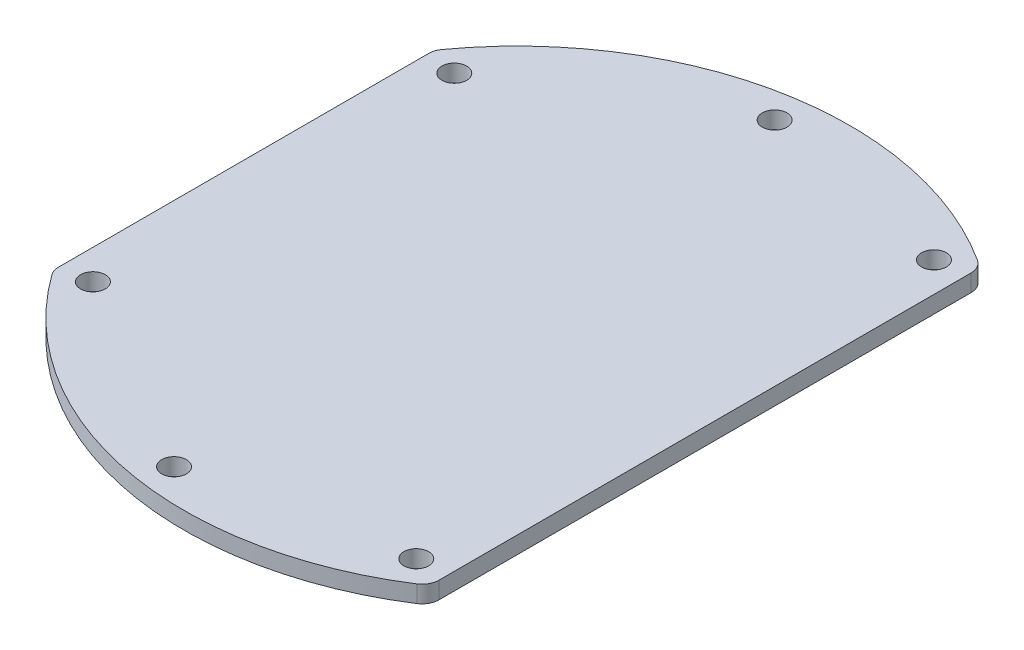
ISO-10303-21;
HEADER;
FILE_DESCRIPTION(('STEP AP214'),'2;1');
FILE_NAME('part.step','',(''),(''),'','','');
FILE_SCHEMA(('AUTOMOTIVE_DESIGN { 1 0 10303 214 1 1 1 1 }'));
ENDSEC;
DATA;
#1=APPLICATION_CONTEXT('core data for automotive mechanical design processes');
#2=APPLICATION_PROTOCOL_DEFINITION('international standard','automotive_design',2000,#1);
#3=PRODUCT_CONTEXT('',#1,'mechanical');
#4=PRODUCT('Part','Part','',(#3));
#5=PRODUCT_RELATED_PRODUCT_CATEGORY('part','',(#4));
#6=PRODUCT_DEFINITION_FORMATION('','',#4);
#7=PRODUCT_DEFINITION_CONTEXT('part definition',#1,'design');
#8=PRODUCT_DEFINITION('design','',#6,#7);
#9=PRODUCT_DEFINITION_SHAPE('','',#8);
#10=(LENGTH_UNIT() NAMED_UNIT(*) SI_UNIT(.MILLI.,.METRE.));
#11=(NAMED_UNIT(*) PLANE_ANGLE_UNIT() SI_UNIT($,.RADIAN.));
#12=(NAMED_UNIT(*) SI_UNIT($,.STERADIAN.) SOLID_ANGLE_UNIT());
#13=UNCERTAINTY_MEASURE_WITH_UNIT(LENGTH_MEASURE(1.E-05),#10,'distance_accuracy_value','');
#14=(GEOMETRIC_REPRESENTATION_CONTEXT(3) GLOBAL_UNCERTAINTY_ASSIGNED_CONTEXT((#13)) GLOBAL_UNIT_ASSIGNED_CONTEXT((#10,
#11,#12)) REPRESENTATION_CONTEXT('',''));
#15=CARTESIAN_POINT('',(0.,0.,0.));
#16=DIRECTION('',(0.,0.,1.));
#17=DIRECTION('',(1.,0.,0.));
#18=AXIS2_PLACEMENT_3D('',#15,#16,#17);
#19=CARTESIAN_POINT('',(0.,2.,0.));
#20=DIRECTION('',(0.,-1.,0.));
#21=DIRECTION('',(0.,0.,-1.));
#22=AXIS2_PLACEMENT_3D('',#19,#20,#21);
#23=CYLINDRICAL_SURFACE('',#22,39.);
#24=CARTESIAN_POINT('',(0.,2.,0.));
#25=DIRECTION('',(0.,1.,0.));
#26=DIRECTION('',(0.,0.,1.));
#27=AXIS2_PLACEMENT_3D('',#24,#25,#26);
#28=CIRCLE('',#27,39.);
#29=CARTESIAN_POINT('',(21.0810810810811,2.,-32.8114007694412));
#30=VERTEX_POINT('',#29);
#31=CARTESIAN_POINT('',(-31.6216216216216,2.,-22.8270244670433));
#32=VERTEX_POINT('',#31);
#33=EDGE_CURVE('E130',#30,#32,#28,.T.);
#34=ORIENTED_EDGE('',*,*,#33,.F.);
#35=DIRECTION('',(0.,-1.,0.));
#36=VECTOR('',#35,1.);
#37=CARTESIAN_POINT('',(21.0810810810811,2.,-32.8114007694412));
#38=LINE('',#37,#36);
#39=CARTESIAN_POINT('',(21.0810810810811,0.,-32.8114007694412));
#40=VERTEX_POINT('',#39);
#41=EDGE_CURVE('E11',#30,#40,#38,.T.);
#42=ORIENTED_EDGE('',*,*,#41,.T.);
#43=CARTESIAN_POINT('',(0.,0.,0.));
#44=DIRECTION('',(0.,1.,0.));
#45=DIRECTION('',(0.,0.,1.));
#46=AXIS2_PLACEMENT_3D('',#43,#44,#45);
#47=CIRCLE('',#46,39.);
#48=CARTESIAN_POINT('',(-31.6216216216216,0.,-22.8270244670433));
#49=VERTEX_POINT('',#48);
#50=EDGE_CURVE('E161',#40,#49,#47,.T.);
#51=ORIENTED_EDGE('',*,*,#50,.T.);
#52=DIRECTION('',(0.,-1.,0.));
#53=VECTOR('',#52,1.);
#54=CARTESIAN_POINT('',(-31.6216216216216,2.,-22.8270244670433));
#55=LINE('',#54,#53);
#56=EDGE_CURVE('E44',#49,#32,#55,.F.);
#57=ORIENTED_EDGE('',*,*,#56,.T.);
#58=EDGE_LOOP('',(#34,#42,#51,#57));
#59=FACE_BOUND('',#58,.T.);
#60=ADVANCED_FACE('F36',(#59),#23,.T.);
#61=CARTESIAN_POINT('',(-32.,2.,-22.2934968096079));
#62=DIRECTION('',(1.,0.,0.));
#63=DIRECTION('',(0.,0.,-1.));
#64=AXIS2_PLACEMENT_3D('',#61,#62,#63);
#65=PLANE('',#64);
#66=DIRECTION('',(0.,0.,1.));
#67=VECTOR('',#66,1.);
#68=CARTESIAN_POINT('',(-32.,0.,-22.2934968096079));
#69=LINE('',#68,#67);
#70=CARTESIAN_POINT('',(-32.,0.,-21.6564078277077));
#71=VERTEX_POINT('',#70);
#72=CARTESIAN_POINT('',(-32.,0.,21.6564078277077));
#73=VERTEX_POINT('',#72);
#74=EDGE_CURVE('E135',#71,#73,#69,.T.);
#75=ORIENTED_EDGE('',*,*,#74,.T.);
#76=DIRECTION('',(0.,-1.,0.));
#77=VECTOR('',#76,1.);
#78=CARTESIAN_POINT('',(-32.,2.,21.6564078277077));
#79=LINE('',#78,#77);
#80=CARTESIAN_POINT('',(-32.,2.,21.6564078277077));
#81=VERTEX_POINT('',#80);
#82=EDGE_CURVE('E51',#73,#81,#79,.F.);
#83=ORIENTED_EDGE('',*,*,#82,.T.);
#84=DIRECTION('',(0.,0.,1.));
#85=VECTOR('',#84,1.);
#86=CARTESIAN_POINT('',(-32.,2.,-22.2934968096079));
#87=LINE('',#86,#85);
#88=CARTESIAN_POINT('',(-32.,2.,-21.6564078277077));
#89=VERTEX_POINT('',#88);
#90=EDGE_CURVE('E133',#89,#81,#87,.T.);
#91=ORIENTED_EDGE('',*,*,#90,.F.);
#92=DIRECTION('',(0.,-1.,0.));
#93=VECTOR('',#92,1.);
#94=CARTESIAN_POINT('',(-32.,2.,-21.6564078277077));
#95=LINE('',#94,#93);
#96=EDGE_CURVE('E153',#89,#71,#95,.T.);
#97=ORIENTED_EDGE('',*,*,#96,.T.);
#98=EDGE_LOOP('',(#75,#83,#91,#97));
#99=FACE_BOUND('',#98,.T.);
#100=ADVANCED_FACE('F168',(#99),#65,.F.);
#101=CARTESIAN_POINT('',(0.,2.,0.));
#102=DIRECTION('',(0.,-1.,0.));
#103=DIRECTION('',(0.,0.,-1.));
#104=AXIS2_PLACEMENT_3D('',#101,#102,#103);
#105=CYLINDRICAL_SURFACE('',#104,39.);
#106=CARTESIAN_POINT('',(0.,0.,0.));
#107=DIRECTION('',(0.,1.,0.));
#108=DIRECTION('',(0.,0.,1.));
#109=AXIS2_PLACEMENT_3D('',#106,#107,#108);
#110=CIRCLE('',#109,39.);
#111=CARTESIAN_POINT('',(-31.6216216216216,0.,22.8270244670433));
#112=VERTEX_POINT('',#111);
#113=CARTESIAN_POINT('',(21.0810810810811,0.,32.8114007694412));
#114=VERTEX_POINT('',#113);
#115=EDGE_CURVE('E131',#112,#114,#110,.T.);
#116=ORIENTED_EDGE('',*,*,#115,.T.);
#117=DIRECTION('',(0.,-1.,0.));
#118=VECTOR('',#117,1.);
#119=CARTESIAN_POINT('',(21.0810810810811,2.,32.8114007694412));
#120=LINE('',#119,#118);
#121=CARTESIAN_POINT('',(21.0810810810811,2.,32.8114007694412));
#122=VERTEX_POINT('',#121);
#123=EDGE_CURVE('E108',#114,#122,#120,.F.);
#124=ORIENTED_EDGE('',*,*,#123,.T.);
#125=CARTESIAN_POINT('',(0.,2.,0.));
#126=DIRECTION('',(0.,1.,0.));
#127=DIRECTION('',(0.,0.,1.));
#128=AXIS2_PLACEMENT_3D('',#125,#126,#127);
#129=CIRCLE('',#128,39.);
#130=CARTESIAN_POINT('',(-31.6216216216216,2.,22.8270244670433));
#131=VERTEX_POINT('',#130);
#132=EDGE_CURVE('E173',#131,#122,#129,.T.);
#133=ORIENTED_EDGE('',*,*,#132,.F.);
#134=DIRECTION('',(0.,-1.,0.));
#135=VECTOR('',#134,1.);
#136=CARTESIAN_POINT('',(-31.6216216216216,2.,22.8270244670433));
#137=LINE('',#136,#135);
#138=EDGE_CURVE('E113',#131,#112,#137,.T.);
#139=ORIENTED_EDGE('',*,*,#138,.T.);
#140=EDGE_LOOP('',(#116,#124,#133,#139));
#141=FACE_BOUND('',#140,.T.);
#142=ADVANCED_FACE('F246',(#141),#105,.T.);
#143=CARTESIAN_POINT('',(22.,2.,32.2024843762092));
#144=DIRECTION('',(-1.,0.,0.));
#145=DIRECTION('',(0.,0.,1.));
#146=AXIS2_PLACEMENT_3D('',#143,#144,#145);
#147=PLANE('',#146);
#148=DIRECTION('',(0.,0.,-1.));
#149=VECTOR('',#148,1.);
#150=CARTESIAN_POINT('',(22.,2.,32.2024843762092));
#151=LINE('',#150,#149);
#152=CARTESIAN_POINT('',(22.,2.,31.1287648325468));
#153=VERTEX_POINT('',#152);
#154=CARTESIAN_POINT('',(22.,2.,-31.1287648325468));
#155=VERTEX_POINT('',#154);
#156=EDGE_CURVE('E123',#153,#155,#151,.T.);
#157=ORIENTED_EDGE('',*,*,#156,.F.);
#158=DIRECTION('',(0.,-1.,0.));
#159=VECTOR('',#158,1.);
#160=CARTESIAN_POINT('',(22.,2.,31.1287648325468));
#161=LINE('',#160,#159);
#162=CARTESIAN_POINT('',(22.,0.,31.1287648325468));
#163=VERTEX_POINT('',#162);
#164=EDGE_CURVE('E107',#153,#163,#161,.T.);
#165=ORIENTED_EDGE('',*,*,#164,.T.);
#166=DIRECTION('',(0.,0.,-1.));
#167=VECTOR('',#166,1.);
#168=CARTESIAN_POINT('',(22.,0.,32.2024843762092));
#169=LINE('',#168,#167);
#170=CARTESIAN_POINT('',(22.,0.,-31.1287648325468));
#171=VERTEX_POINT('',#170);
#172=EDGE_CURVE('E120',#163,#171,#169,.T.);
#173=ORIENTED_EDGE('',*,*,#172,.T.);
#174=DIRECTION('',(0.,-1.,0.));
#175=VECTOR('',#174,1.);
#176=CARTESIAN_POINT('',(22.,2.,-31.1287648325468));
#177=LINE('',#176,#175);
#178=EDGE_CURVE('E125',#171,#155,#177,.F.);
#179=ORIENTED_EDGE('',*,*,#178,.T.);
#180=EDGE_LOOP('',(#157,#165,#173,#179));
#181=FACE_BOUND('',#180,.T.);
#182=ADVANCED_FACE('F119',(#181),#147,.F.);
#183=CARTESIAN_POINT('',(0.,2.,0.));
#184=DIRECTION('',(0.,1.,0.));
#185=DIRECTION('',(0.,0.,1.));
#186=AXIS2_PLACEMENT_3D('',#183,#184,#185);
#187=PLANE('',#186);
#188=CARTESIAN_POINT('',(-28.5,2.,-21.15));
#189=DIRECTION('',(0.,1.,0.));
#190=DIRECTION('',(0.,0.,1.));
#191=AXIS2_PLACEMENT_3D('',#188,#189,#190);
#192=CIRCLE('',#191,1.45);
#193=CARTESIAN_POINT('',(-28.5,2.,-19.7));
#194=VERTEX_POINT('',#193);
#195=EDGE_CURVE('E208',#194,#194,#192,.T.);
#196=ORIENTED_EDGE('',*,*,#195,.F.);
#197=EDGE_LOOP('',(#196));
#198=FACE_BOUND('',#197,.T.);
#199=CARTESIAN_POINT('',(-28.5,2.,21.15));
#200=DIRECTION('',(0.,1.,0.));
#201=DIRECTION('',(0.,0.,1.));
#202=AXIS2_PLACEMENT_3D('',#199,#200,#201);
#203=CIRCLE('',#202,1.45);
#204=CARTESIAN_POINT('',(-28.5,2.,22.6));
#205=VERTEX_POINT('',#204);
#206=EDGE_CURVE('E202',#205,#205,#203,.T.);
#207=ORIENTED_EDGE('',*,*,#206,.F.);
#208=EDGE_LOOP('',(#207));
#209=FACE_BOUND('',#208,.T.);
#210=CARTESIAN_POINT('',(18.5,2.,30.3));
#211=DIRECTION('',(0.,1.,0.));
#212=DIRECTION('',(0.,0.,1.));
#213=AXIS2_PLACEMENT_3D('',#210,#211,#212);
#214=CIRCLE('',#213,1.45);
#215=CARTESIAN_POINT('',(18.5,2.,31.75));
#216=VERTEX_POINT('',#215);
#217=EDGE_CURVE('E196',#216,#216,#214,.T.);
#218=ORIENTED_EDGE('',*,*,#217,.F.);
#219=EDGE_LOOP('',(#218));
#220=FACE_BOUND('',#219,.T.);
#221=CARTESIAN_POINT('',(18.5,2.,-30.3));
#222=DIRECTION('',(0.,1.,0.));
#223=DIRECTION('',(0.,0.,1.));
#224=AXIS2_PLACEMENT_3D('',#221,#222,#223);
#225=CIRCLE('',#224,1.45);
#226=CARTESIAN_POINT('',(18.5,2.,-28.85));
#227=VERTEX_POINT('',#226);
#228=EDGE_CURVE('E190',#227,#227,#225,.T.);
#229=ORIENTED_EDGE('',*,*,#228,.F.);
#230=EDGE_LOOP('',(#229));
#231=FACE_BOUND('',#230,.T.);
#232=CARTESIAN_POINT('',(-5.00000000000001,2.,-35.15));
#233=DIRECTION('',(0.,1.,0.));
#234=DIRECTION('',(0.,0.,1.));
#235=AXIS2_PLACEMENT_3D('',#232,#233,#234);
#236=CIRCLE('',#235,1.45);
#237=CARTESIAN_POINT('',(-5.00000000000001,2.,-33.7));
#238=VERTEX_POINT('',#237);
#239=EDGE_CURVE('E184',#238,#238,#236,.T.);
#240=ORIENTED_EDGE('',*,*,#239,.F.);
#241=EDGE_LOOP('',(#240));
#242=FACE_BOUND('',#241,.T.);
#243=CARTESIAN_POINT('',(-5.,2.,35.15));
#244=DIRECTION('',(0.,1.,0.));
#245=DIRECTION('',(0.,0.,1.));
#246=AXIS2_PLACEMENT_3D('',#243,#244,#245);
#247=CIRCLE('',#246,1.45);
#248=CARTESIAN_POINT('',(-5.,2.,36.6));
#249=VERTEX_POINT('',#248);
#250=EDGE_CURVE('E178',#249,#249,#247,.T.);
#251=ORIENTED_EDGE('',*,*,#250,.F.);
#252=EDGE_LOOP('',(#251));
#253=FACE_BOUND('',#252,.T.);
#254=ORIENTED_EDGE('',*,*,#132,.T.);
#255=CARTESIAN_POINT('',(20.,2.,31.1287648325468));
#256=DIRECTION('',(0.,1.,0.));
#257=DIRECTION('',(0.,0.,1.));
#258=AXIS2_PLACEMENT_3D('',#255,#256,#257);
#259=CIRCLE('',#258,2.);
#260=EDGE_CURVE('E151',#122,#153,#259,.T.);
#261=ORIENTED_EDGE('',*,*,#260,.T.);
#262=ORIENTED_EDGE('',*,*,#156,.T.);
#263=CARTESIAN_POINT('',(20.,2.,-31.1287648325468));
#264=DIRECTION('',(0.,1.,0.));
#265=DIRECTION('',(0.,0.,1.));
#266=AXIS2_PLACEMENT_3D('',#263,#264,#265);
#267=CIRCLE('',#266,2.);
#268=EDGE_CURVE('E147',#155,#30,#267,.T.);
#269=ORIENTED_EDGE('',*,*,#268,.T.);
#270=ORIENTED_EDGE('',*,*,#33,.T.);
#271=CARTESIAN_POINT('',(-30.,2.,-21.6564078277077));
#272=DIRECTION('',(0.,1.,0.));
#273=DIRECTION('',(0.,0.,1.));
#274=AXIS2_PLACEMENT_3D('',#271,#272,#273);
#275=CIRCLE('',#274,2.);
#276=EDGE_CURVE('E58',#32,#89,#275,.T.);
#277=ORIENTED_EDGE('',*,*,#276,.T.);
#278=ORIENTED_EDGE('',*,*,#90,.T.);
#279=CARTESIAN_POINT('',(-30.,2.,21.6564078277077));
#280=DIRECTION('',(0.,1.,0.));
#281=DIRECTION('',(0.,0.,1.));
#282=AXIS2_PLACEMENT_3D('',#279,#280,#281);
#283=CIRCLE('',#282,2.);
#284=EDGE_CURVE('E149',#81,#131,#283,.T.);
#285=ORIENTED_EDGE('',*,*,#284,.T.);
#286=EDGE_LOOP('',(#254,#261,#262,#269,#270,#277,#278,#285));
#287=FACE_BOUND('',#286,.T.);
#288=ADVANCED_FACE('F164',(#198,#209,#220,#231,#242,#253,#287),#187,.T.);
#289=CARTESIAN_POINT('',(0.,0.,0.));
#290=DIRECTION('',(0.,1.,0.));
#291=DIRECTION('',(0.,0.,1.));
#292=AXIS2_PLACEMENT_3D('',#289,#290,#291);
#293=PLANE('',#292);
#294=CARTESIAN_POINT('',(-28.5,0.,-21.15));
#295=DIRECTION('',(0.,1.,0.));
#296=DIRECTION('',(0.,0.,1.));
#297=AXIS2_PLACEMENT_3D('',#294,#295,#296);
#298=CIRCLE('',#297,1.45);
#299=CARTESIAN_POINT('',(-28.5,0.,-19.7));
#300=VERTEX_POINT('',#299);
#301=EDGE_CURVE('E205',#300,#300,#298,.T.);
#302=ORIENTED_EDGE('',*,*,#301,.T.);
#303=EDGE_LOOP('',(#302));
#304=FACE_BOUND('',#303,.T.);
#305=CARTESIAN_POINT('',(-28.5,0.,21.15));
#306=DIRECTION('',(0.,1.,0.));
#307=DIRECTION('',(0.,0.,1.));
#308=AXIS2_PLACEMENT_3D('',#305,#306,#307);
#309=CIRCLE('',#308,1.45);
#310=CARTESIAN_POINT('',(-28.5,0.,22.6));
#311=VERTEX_POINT('',#310);
#312=EDGE_CURVE('E199',#311,#311,#309,.T.);
#313=ORIENTED_EDGE('',*,*,#312,.T.);
#314=EDGE_LOOP('',(#313));
#315=FACE_BOUND('',#314,.T.);
#316=CARTESIAN_POINT('',(18.5,0.,30.3));
#317=DIRECTION('',(0.,1.,0.));
#318=DIRECTION('',(0.,0.,1.));
#319=AXIS2_PLACEMENT_3D('',#316,#317,#318);
#320=CIRCLE('',#319,1.45);
#321=CARTESIAN_POINT('',(18.5,0.,31.75));
#322=VERTEX_POINT('',#321);
#323=EDGE_CURVE('E193',#322,#322,#320,.T.);
#324=ORIENTED_EDGE('',*,*,#323,.T.);
#325=EDGE_LOOP('',(#324));
#326=FACE_BOUND('',#325,.T.);
#327=CARTESIAN_POINT('',(18.5,0.,-30.3));
#328=DIRECTION('',(0.,1.,0.));
#329=DIRECTION('',(0.,0.,1.));
#330=AXIS2_PLACEMENT_3D('',#327,#328,#329);
#331=CIRCLE('',#330,1.45);
#332=CARTESIAN_POINT('',(18.5,0.,-28.85));
#333=VERTEX_POINT('',#332);
#334=EDGE_CURVE('E187',#333,#333,#331,.T.);
#335=ORIENTED_EDGE('',*,*,#334,.T.);
#336=EDGE_LOOP('',(#335));
#337=FACE_BOUND('',#336,.T.);
#338=CARTESIAN_POINT('',(-5.00000000000001,0.,-35.15));
#339=DIRECTION('',(0.,1.,0.));
#340=DIRECTION('',(0.,0.,1.));
#341=AXIS2_PLACEMENT_3D('',#338,#339,#340);
#342=CIRCLE('',#341,1.45);
#343=CARTESIAN_POINT('',(-5.00000000000001,0.,-33.7));
#344=VERTEX_POINT('',#343);
#345=EDGE_CURVE('E181',#344,#344,#342,.T.);
#346=ORIENTED_EDGE('',*,*,#345,.T.);
#347=EDGE_LOOP('',(#346));
#348=FACE_BOUND('',#347,.T.);
#349=CARTESIAN_POINT('',(-5.,0.,35.15));
#350=DIRECTION('',(0.,1.,0.));
#351=DIRECTION('',(0.,0.,1.));
#352=AXIS2_PLACEMENT_3D('',#349,#350,#351);
#353=CIRCLE('',#352,1.45);
#354=CARTESIAN_POINT('',(-5.,0.,36.6));
#355=VERTEX_POINT('',#354);
#356=EDGE_CURVE('E169',#355,#355,#353,.T.);
#357=ORIENTED_EDGE('',*,*,#356,.T.);
#358=EDGE_LOOP('',(#357));
#359=FACE_BOUND('',#358,.T.);
#360=ORIENTED_EDGE('',*,*,#172,.F.);
#361=CARTESIAN_POINT('',(20.,0.,31.1287648325468));
#362=DIRECTION('',(0.,1.,0.));
#363=DIRECTION('',(0.,0.,1.));
#364=AXIS2_PLACEMENT_3D('',#361,#362,#363);
#365=CIRCLE('',#364,2.);
#366=EDGE_CURVE('E103',#163,#114,#365,.F.);
#367=ORIENTED_EDGE('',*,*,#366,.T.);
#368=ORIENTED_EDGE('',*,*,#115,.F.);
#369=CARTESIAN_POINT('',(-30.,0.,21.6564078277077));
#370=DIRECTION('',(0.,1.,0.));
#371=DIRECTION('',(0.,0.,1.));
#372=AXIS2_PLACEMENT_3D('',#369,#370,#371);
#373=CIRCLE('',#372,2.);
#374=EDGE_CURVE('E114',#112,#73,#373,.F.);
#375=ORIENTED_EDGE('',*,*,#374,.T.);
#376=ORIENTED_EDGE('',*,*,#74,.F.);
#377=CARTESIAN_POINT('',(-30.,0.,-21.6564078277077));
#378=DIRECTION('',(0.,1.,0.));
#379=DIRECTION('',(0.,0.,1.));
#380=AXIS2_PLACEMENT_3D('',#377,#378,#379);
#381=CIRCLE('',#380,2.);
#382=EDGE_CURVE('E124',#71,#49,#381,.F.);
#383=ORIENTED_EDGE('',*,*,#382,.T.);
#384=ORIENTED_EDGE('',*,*,#50,.F.);
#385=CARTESIAN_POINT('',(20.,0.,-31.1287648325468));
#386=DIRECTION('',(0.,1.,0.));
#387=DIRECTION('',(0.,0.,1.));
#388=AXIS2_PLACEMENT_3D('',#385,#386,#387);
#389=CIRCLE('',#388,2.);
#390=EDGE_CURVE('E129',#40,#171,#389,.F.);
#391=ORIENTED_EDGE('',*,*,#390,.T.);
#392=EDGE_LOOP('',(#360,#367,#368,#375,#376,#383,#384,#391));
#393=FACE_BOUND('',#392,.T.);
#394=ADVANCED_FACE('F127',(#304,#315,#326,#337,#348,#359,#393),#293,.F.);
#395=CARTESIAN_POINT('',(20.,2.,31.1287648325468));
#396=DIRECTION('',(0.,-1.,0.));
#397=DIRECTION('',(0.,0.,-1.));
#398=AXIS2_PLACEMENT_3D('',#395,#396,#397);
#399=CYLINDRICAL_SURFACE('',#398,2.);
#400=ORIENTED_EDGE('',*,*,#260,.F.);
#401=ORIENTED_EDGE('',*,*,#123,.F.);
#402=ORIENTED_EDGE('',*,*,#366,.F.);
#403=ORIENTED_EDGE('',*,*,#164,.F.);
#404=EDGE_LOOP('',(#400,#401,#402,#403));
#405=FACE_BOUND('',#404,.T.);
#406=ADVANCED_FACE('F106',(#405),#399,.T.);
#407=CARTESIAN_POINT('',(-30.,2.,21.6564078277077));
#408=DIRECTION('',(0.,-1.,0.));
#409=DIRECTION('',(0.,0.,-1.));
#410=AXIS2_PLACEMENT_3D('',#407,#408,#409);
#411=CYLINDRICAL_SURFACE('',#410,2.);
#412=ORIENTED_EDGE('',*,*,#284,.F.);
#413=ORIENTED_EDGE('',*,*,#82,.F.);
#414=ORIENTED_EDGE('',*,*,#374,.F.);
#415=ORIENTED_EDGE('',*,*,#138,.F.);
#416=EDGE_LOOP('',(#412,#413,#414,#415));
#417=FACE_BOUND('',#416,.T.);
#418=ADVANCED_FACE('F252',(#417),#411,.T.);
#419=CARTESIAN_POINT('',(20.,2.,-31.1287648325468));
#420=DIRECTION('',(0.,-1.,0.));
#421=DIRECTION('',(0.,0.,-1.));
#422=AXIS2_PLACEMENT_3D('',#419,#420,#421);
#423=CYLINDRICAL_SURFACE('',#422,2.);
#424=ORIENTED_EDGE('',*,*,#268,.F.);
#425=ORIENTED_EDGE('',*,*,#178,.F.);
#426=ORIENTED_EDGE('',*,*,#390,.F.);
#427=ORIENTED_EDGE('',*,*,#41,.F.);
#428=EDGE_LOOP('',(#424,#425,#426,#427));
#429=FACE_BOUND('',#428,.T.);
#430=ADVANCED_FACE('F239',(#429),#423,.T.);
#431=CARTESIAN_POINT('',(-30.,2.,-21.6564078277077));
#432=DIRECTION('',(0.,-1.,0.));
#433=DIRECTION('',(0.,0.,-1.));
#434=AXIS2_PLACEMENT_3D('',#431,#432,#433);
#435=CYLINDRICAL_SURFACE('',#434,2.);
#436=ORIENTED_EDGE('',*,*,#276,.F.);
#437=ORIENTED_EDGE('',*,*,#56,.F.);
#438=ORIENTED_EDGE('',*,*,#382,.F.);
#439=ORIENTED_EDGE('',*,*,#96,.F.);
#440=EDGE_LOOP('',(#436,#437,#438,#439));
#441=FACE_BOUND('',#440,.T.);
#442=ADVANCED_FACE('F38',(#441),#435,.T.);
#443=CARTESIAN_POINT('',(-5.,2.,35.15));
#444=DIRECTION('',(0.,1.,0.));
#445=DIRECTION('',(0.,0.,1.));
#446=AXIS2_PLACEMENT_3D('',#443,#444,#445);
#447=CYLINDRICAL_SURFACE('',#446,1.45);
#448=ORIENTED_EDGE('',*,*,#356,.F.);
#449=EDGE_LOOP('',(#448));
#450=FACE_BOUND('',#449,.T.);
#451=ORIENTED_EDGE('',*,*,#250,.T.);
#452=EDGE_LOOP('',(#451));
#453=FACE_BOUND('',#452,.T.);
#454=ADVANCED_FACE('F227',(#450,#453),#447,.F.);
#455=CARTESIAN_POINT('',(-5.00000000000001,2.,-35.15));
#456=DIRECTION('',(0.,1.,0.));
#457=DIRECTION('',(0.,0.,1.));
#458=AXIS2_PLACEMENT_3D('',#455,#456,#457);
#459=CYLINDRICAL_SURFACE('',#458,1.45);
#460=ORIENTED_EDGE('',*,*,#345,.F.);
#461=EDGE_LOOP('',(#460));
#462=FACE_BOUND('',#461,.T.);
#463=ORIENTED_EDGE('',*,*,#239,.T.);
#464=EDGE_LOOP('',(#463));
#465=FACE_BOUND('',#464,.T.);
#466=ADVANCED_FACE('F229',(#462,#465),#459,.F.);
#467=CARTESIAN_POINT('',(18.5,2.,-30.3));
#468=DIRECTION('',(0.,1.,0.));
#469=DIRECTION('',(0.,0.,1.));
#470=AXIS2_PLACEMENT_3D('',#467,#468,#469);
#471=CYLINDRICAL_SURFACE('',#470,1.45);
#472=ORIENTED_EDGE('',*,*,#334,.F.);
#473=EDGE_LOOP('',(#472));
#474=FACE_BOUND('',#473,.T.);
#475=ORIENTED_EDGE('',*,*,#228,.T.);
#476=EDGE_LOOP('',(#475));
#477=FACE_BOUND('',#476,.T.);
#478=ADVANCED_FACE('F236',(#474,#477),#471,.F.);
#479=CARTESIAN_POINT('',(18.5,2.,30.3));
#480=DIRECTION('',(0.,1.,0.));
#481=DIRECTION('',(0.,0.,1.));
#482=AXIS2_PLACEMENT_3D('',#479,#480,#481);
#483=CYLINDRICAL_SURFACE('',#482,1.45);
#484=ORIENTED_EDGE('',*,*,#323,.F.);
#485=EDGE_LOOP('',(#484));
#486=FACE_BOUND('',#485,.T.);
#487=ORIENTED_EDGE('',*,*,#217,.T.);
#488=EDGE_LOOP('',(#487));
#489=FACE_BOUND('',#488,.T.);
#490=ADVANCED_FACE('F287',(#486,#489),#483,.F.);
#491=CARTESIAN_POINT('',(-28.5,2.,21.15));
#492=DIRECTION('',(0.,1.,0.));
#493=DIRECTION('',(0.,0.,1.));
#494=AXIS2_PLACEMENT_3D('',#491,#492,#493);
#495=CYLINDRICAL_SURFACE('',#494,1.45);
#496=ORIENTED_EDGE('',*,*,#312,.F.);
#497=EDGE_LOOP('',(#496));
#498=FACE_BOUND('',#497,.T.);
#499=ORIENTED_EDGE('',*,*,#206,.T.);
#500=EDGE_LOOP('',(#499));
#501=FACE_BOUND('',#500,.T.);
#502=ADVANCED_FACE('F292',(#498,#501),#495,.F.);
#503=CARTESIAN_POINT('',(-28.5,2.,-21.15));
#504=DIRECTION('',(0.,1.,0.));
#505=DIRECTION('',(0.,0.,1.));
#506=AXIS2_PLACEMENT_3D('',#503,#504,#505);
#507=CYLINDRICAL_SURFACE('',#506,1.45);
#508=ORIENTED_EDGE('',*,*,#301,.F.);
#509=EDGE_LOOP('',(#508));
#510=FACE_BOUND('',#509,.T.);
#511=ORIENTED_EDGE('',*,*,#195,.T.);
#512=EDGE_LOOP('',(#511));
#513=FACE_BOUND('',#512,.T.);
#514=ADVANCED_FACE('F212',(#510,#513),#507,.F.);
#515=CLOSED_SHELL('',(#60,#100,#142,#182,#288,#394,#406,#418,#430,#442,#454,#466,#478,#490,#502,#514));
#516=MANIFOLD_SOLID_BREP('B2',#515);
#517=ADVANCED_BREP_SHAPE_REPRESENTATION('',(#18,#516),#14);
#518=SHAPE_DEFINITION_REPRESENTATION(#9,#517);
ENDSEC;
END-ISO-10303-21;
